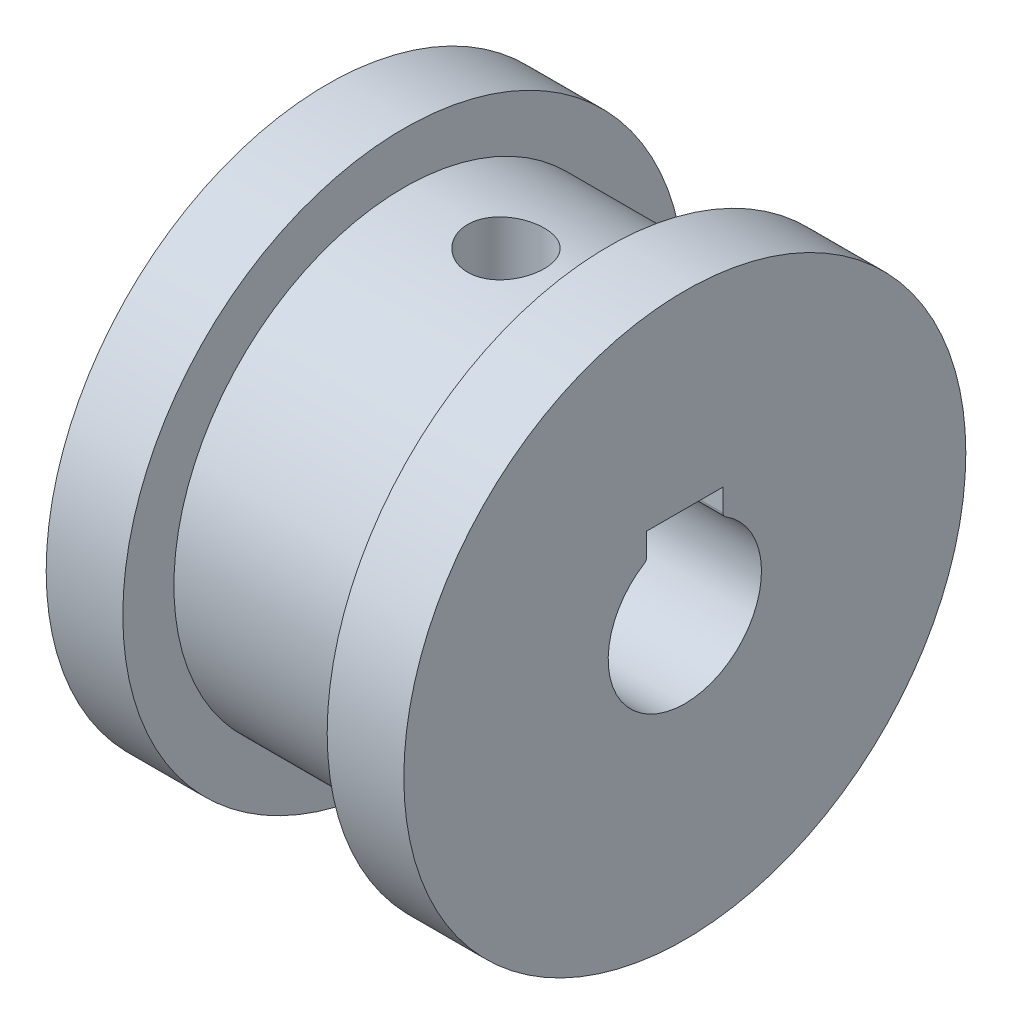
ISO-10303-21;
HEADER;
FILE_DESCRIPTION(('STEP AP214'),'2;1');
FILE_NAME('part.step','',(''),(''),'','','');
FILE_SCHEMA(('AUTOMOTIVE_DESIGN { 1 0 10303 214 1 1 1 1 }'));
ENDSEC;
DATA;
#1=APPLICATION_CONTEXT('core data for automotive mechanical design processes');
#2=APPLICATION_PROTOCOL_DEFINITION('international standard','automotive_design',2000,#1);
#3=PRODUCT_CONTEXT('',#1,'mechanical');
#4=PRODUCT('Part','Part','',(#3));
#5=PRODUCT_RELATED_PRODUCT_CATEGORY('part','',(#4));
#6=PRODUCT_DEFINITION_FORMATION('','',#4);
#7=PRODUCT_DEFINITION_CONTEXT('part definition',#1,'design');
#8=PRODUCT_DEFINITION('design','',#6,#7);
#9=PRODUCT_DEFINITION_SHAPE('','',#8);
#10=(LENGTH_UNIT() NAMED_UNIT(*) SI_UNIT(.MILLI.,.METRE.));
#11=(NAMED_UNIT(*) PLANE_ANGLE_UNIT() SI_UNIT($,.RADIAN.));
#12=(NAMED_UNIT(*) SI_UNIT($,.STERADIAN.) SOLID_ANGLE_UNIT());
#13=UNCERTAINTY_MEASURE_WITH_UNIT(LENGTH_MEASURE(1.E-05),#10,'distance_accuracy_value','');
#14=(GEOMETRIC_REPRESENTATION_CONTEXT(3) GLOBAL_UNCERTAINTY_ASSIGNED_CONTEXT((#13)) GLOBAL_UNIT_ASSIGNED_CONTEXT((#10,
#11,#12)) REPRESENTATION_CONTEXT('',''));
#15=CARTESIAN_POINT('',(0.,0.,0.));
#16=DIRECTION('',(0.,0.,1.));
#17=DIRECTION('',(1.,0.,0.));
#18=AXIS2_PLACEMENT_3D('',#15,#16,#17);
#19=CARTESIAN_POINT('',(11.,3.59807621135332,1.5));
#20=DIRECTION('',(0.,-1.,0.));
#21=DIRECTION('',(0.,0.,-1.));
#22=AXIS2_PLACEMENT_3D('',#19,#20,#21);
#23=PLANE('',#22);
#24=CARTESIAN_POINT('',(4.,3.59807621135332,0.));
#25=DIRECTION('',(0.,-1.,0.));
#26=DIRECTION('',(0.,0.,-1.));
#27=AXIS2_PLACEMENT_3D('',#24,#25,#26);
#28=CIRCLE('',#27,1.5);
#29=CARTESIAN_POINT('',(4.,3.59807621135332,-1.5));
#30=VERTEX_POINT('',#29);
#31=CARTESIAN_POINT('',(4.,3.59807621135332,1.5));
#32=VERTEX_POINT('',#31);
#33=EDGE_CURVE('E48',#30,#32,#28,.T.);
#34=ORIENTED_EDGE('',*,*,#33,.F.);
#35=DIRECTION('',(-1.,0.,0.));
#36=VECTOR('',#35,1.);
#37=CARTESIAN_POINT('',(11.,3.59807621135332,-1.5));
#38=LINE('',#37,#36);
#39=CARTESIAN_POINT('',(11.,3.59807621135332,-1.5));
#40=VERTEX_POINT('',#39);
#41=EDGE_CURVE('E100',#40,#30,#38,.T.);
#42=ORIENTED_EDGE('',*,*,#41,.F.);
#43=DIRECTION('',(0.,0.,1.));
#44=VECTOR('',#43,1.);
#45=CARTESIAN_POINT('',(11.,3.59807621135332,1.5));
#46=LINE('',#45,#44);
#47=CARTESIAN_POINT('',(11.,3.59807621135332,1.5));
#48=VERTEX_POINT('',#47);
#49=EDGE_CURVE('E217',#40,#48,#46,.T.);
#50=ORIENTED_EDGE('',*,*,#49,.T.);
#51=DIRECTION('',(-1.,0.,0.));
#52=VECTOR('',#51,1.);
#53=CARTESIAN_POINT('',(11.,3.59807621135332,1.5));
#54=LINE('',#53,#52);
#55=EDGE_CURVE('E56',#48,#32,#54,.T.);
#56=ORIENTED_EDGE('',*,*,#55,.T.);
#57=EDGE_LOOP('',(#34,#42,#50,#56));
#58=FACE_BOUND('',#57,.T.);
#59=ADVANCED_FACE('F32',(#58),#23,.T.);
#60=CARTESIAN_POINT('',(11.,0.,0.));
#61=DIRECTION('',(1.,0.,0.));
#62=DIRECTION('',(0.,0.,-1.));
#63=AXIS2_PLACEMENT_3D('',#60,#61,#62);
#64=PLANE('',#63);
#65=CARTESIAN_POINT('',(11.,0.,0.));
#66=DIRECTION('',(1.,0.,0.));
#67=DIRECTION('',(0.,0.,-1.));
#68=AXIS2_PLACEMENT_3D('',#65,#66,#67);
#69=CIRCLE('',#68,11.);
#70=CARTESIAN_POINT('',(11.,0.,-11.));
#71=VERTEX_POINT('',#70);
#72=EDGE_CURVE('E42',#71,#71,#69,.T.);
#73=ORIENTED_EDGE('',*,*,#72,.T.);
#74=EDGE_LOOP('',(#73));
#75=FACE_BOUND('',#74,.T.);
#76=CARTESIAN_POINT('',(11.,0.,0.));
#77=DIRECTION('',(1.,0.,0.));
#78=DIRECTION('',(0.,0.,-1.));
#79=AXIS2_PLACEMENT_3D('',#76,#77,#78);
#80=CIRCLE('',#79,3.);
#81=CARTESIAN_POINT('',(11.,2.54164532094862,1.59375));
#82=VERTEX_POINT('',#81);
#83=CARTESIAN_POINT('',(11.,2.54164532094862,-1.59375));
#84=VERTEX_POINT('',#83);
#85=EDGE_CURVE('E207',#82,#84,#80,.T.);
#86=ORIENTED_EDGE('',*,*,#85,.F.);
#87=CARTESIAN_POINT('',(11.,2.71108834234519,1.7));
#88=DIRECTION('',(-1.,0.,0.));
#89=DIRECTION('',(0.,0.,-1.));
#90=AXIS2_PLACEMENT_3D('',#87,#88,#89);
#91=CIRCLE('',#90,0.2);
#92=CARTESIAN_POINT('',(11.,2.71108834234519,1.5));
#93=VERTEX_POINT('',#92);
#94=EDGE_CURVE('E205',#93,#82,#91,.T.);
#95=ORIENTED_EDGE('',*,*,#94,.F.);
#96=DIRECTION('',(0.,-1.,0.));
#97=VECTOR('',#96,1.);
#98=CARTESIAN_POINT('',(11.,3.59807621135332,1.5));
#99=LINE('',#98,#97);
#100=EDGE_CURVE('E219',#48,#93,#99,.T.);
#101=ORIENTED_EDGE('',*,*,#100,.F.);
#102=ORIENTED_EDGE('',*,*,#49,.F.);
#103=DIRECTION('',(0.,1.,0.));
#104=VECTOR('',#103,1.);
#105=CARTESIAN_POINT('',(11.,3.59807621135332,-1.5));
#106=LINE('',#105,#104);
#107=CARTESIAN_POINT('',(11.,2.71108834234519,-1.5));
#108=VERTEX_POINT('',#107);
#109=EDGE_CURVE('E115',#108,#40,#106,.T.);
#110=ORIENTED_EDGE('',*,*,#109,.F.);
#111=CARTESIAN_POINT('',(11.,2.71108834234519,-1.7));
#112=DIRECTION('',(-1.,0.,0.));
#113=DIRECTION('',(0.,0.,1.));
#114=AXIS2_PLACEMENT_3D('',#111,#112,#113);
#115=CIRCLE('',#114,0.2);
#116=EDGE_CURVE('E214',#84,#108,#115,.T.);
#117=ORIENTED_EDGE('',*,*,#116,.F.);
#118=EDGE_LOOP('',(#86,#95,#101,#102,#110,#117));
#119=FACE_BOUND('',#118,.T.);
#120=ADVANCED_FACE('F162',(#75,#119),#64,.T.);
#121=CARTESIAN_POINT('',(-3.,0.,0.));
#122=DIRECTION('',(-1.,0.,0.));
#123=DIRECTION('',(0.,0.,1.));
#124=AXIS2_PLACEMENT_3D('',#121,#122,#123);
#125=PLANE('',#124);
#126=CARTESIAN_POINT('',(-3.,0.,0.));
#127=DIRECTION('',(-1.,0.,0.));
#128=DIRECTION('',(0.,0.,1.));
#129=AXIS2_PLACEMENT_3D('',#126,#127,#128);
#130=CIRCLE('',#129,11.);
#131=CARTESIAN_POINT('',(-3.,0.,11.));
#132=VERTEX_POINT('',#131);
#133=EDGE_CURVE('E126',#132,#132,#130,.T.);
#134=ORIENTED_EDGE('',*,*,#133,.T.);
#135=EDGE_LOOP('',(#134));
#136=FACE_BOUND('',#135,.T.);
#137=DIRECTION('',(0.,-1.,0.));
#138=VECTOR('',#137,1.);
#139=CARTESIAN_POINT('',(-3.,3.59807621135332,1.5));
#140=LINE('',#139,#138);
#141=CARTESIAN_POINT('',(-3.,3.59807621135332,1.5));
#142=VERTEX_POINT('',#141);
#143=CARTESIAN_POINT('',(-3.,2.71108834234519,1.5));
#144=VERTEX_POINT('',#143);
#145=EDGE_CURVE('E201',#142,#144,#140,.T.);
#146=ORIENTED_EDGE('',*,*,#145,.T.);
#147=CARTESIAN_POINT('',(-3.,2.71108834234519,1.7));
#148=DIRECTION('',(-1.,0.,0.));
#149=DIRECTION('',(0.,0.,-1.));
#150=AXIS2_PLACEMENT_3D('',#147,#148,#149);
#151=CIRCLE('',#150,0.2);
#152=CARTESIAN_POINT('',(-3.,2.54164532094862,1.59375));
#153=VERTEX_POINT('',#152);
#154=EDGE_CURVE('E203',#144,#153,#151,.T.);
#155=ORIENTED_EDGE('',*,*,#154,.T.);
#156=CARTESIAN_POINT('',(-3.,0.,0.));
#157=DIRECTION('',(1.,0.,0.));
#158=DIRECTION('',(0.,0.,-1.));
#159=AXIS2_PLACEMENT_3D('',#156,#157,#158);
#160=CIRCLE('',#159,3.);
#161=CARTESIAN_POINT('',(-3.,2.54164532094862,-1.59375));
#162=VERTEX_POINT('',#161);
#163=EDGE_CURVE('E234',#153,#162,#160,.T.);
#164=ORIENTED_EDGE('',*,*,#163,.T.);
#165=CARTESIAN_POINT('',(-3.,2.71108834234519,-1.7));
#166=DIRECTION('',(-1.,0.,0.));
#167=DIRECTION('',(0.,0.,1.));
#168=AXIS2_PLACEMENT_3D('',#165,#166,#167);
#169=CIRCLE('',#168,0.2);
#170=CARTESIAN_POINT('',(-3.,2.71108834234519,-1.5));
#171=VERTEX_POINT('',#170);
#172=EDGE_CURVE('E233',#162,#171,#169,.T.);
#173=ORIENTED_EDGE('',*,*,#172,.T.);
#174=DIRECTION('',(0.,1.,0.));
#175=VECTOR('',#174,1.);
#176=CARTESIAN_POINT('',(-3.,3.59807621135332,-1.5));
#177=LINE('',#176,#175);
#178=CARTESIAN_POINT('',(-3.,3.59807621135332,-1.5));
#179=VERTEX_POINT('',#178);
#180=EDGE_CURVE('E209',#171,#179,#177,.T.);
#181=ORIENTED_EDGE('',*,*,#180,.T.);
#182=DIRECTION('',(0.,0.,1.));
#183=VECTOR('',#182,1.);
#184=CARTESIAN_POINT('',(-3.,3.59807621135332,1.5));
#185=LINE('',#184,#183);
#186=EDGE_CURVE('E107',#179,#142,#185,.T.);
#187=ORIENTED_EDGE('',*,*,#186,.T.);
#188=EDGE_LOOP('',(#146,#155,#164,#173,#181,#187));
#189=FACE_BOUND('',#188,.T.);
#190=ADVANCED_FACE('F167',(#136,#189),#125,.T.);
#191=CARTESIAN_POINT('',(8.,0.,0.));
#192=DIRECTION('',(-1.,0.,0.));
#193=DIRECTION('',(0.,0.,1.));
#194=AXIS2_PLACEMENT_3D('',#191,#192,#193);
#195=CYLINDRICAL_SURFACE('',#194,9.);
#196=CARTESIAN_POINT('',(4.,8.87411967464942,-1.5));
#197=CARTESIAN_POINT('',(4.08362544888762,8.87412118440766,-1.4999966390526));
#198=CARTESIAN_POINT('',(4.16729656361492,8.8753145552884,-1.49298310142239));
#199=CARTESIAN_POINT('',(4.3322911259321,8.87995474420907,-1.46512645684523));
#200=CARTESIAN_POINT('',(4.41361233624971,8.88340364034856,-1.44427059618579));
#201=CARTESIAN_POINT('',(4.57149537001406,8.89215365593394,-1.38937772620028));
#202=CARTESIAN_POINT('',(4.64806110919979,8.8974532270317,-1.35535173295865));
#203=CARTESIAN_POINT('',(4.79438857282822,8.90930563268603,-1.27511189813422));
#204=CARTESIAN_POINT('',(4.86415106174574,8.91585832618484,-1.22889942810094));
#205=CARTESIAN_POINT('',(4.9955877098474,8.92955082691565,-1.12511251617978));
#206=CARTESIAN_POINT('',(5.05718507883191,8.93669530396241,-1.06744142935936));
#207=CARTESIAN_POINT('',(5.16987598411691,8.95072488401674,-0.942583202817202));
#208=CARTESIAN_POINT('',(5.2209688978692,8.95760997163182,-0.875395499489992));
#209=CARTESIAN_POINT('',(5.31148874033161,8.97039442189482,-0.732913721969002));
#210=CARTESIAN_POINT('',(5.35084420463909,8.97628765459366,-0.657573648874021));
#211=CARTESIAN_POINT('',(5.41631264231832,8.98637242174293,-0.501237373034323));
#212=CARTESIAN_POINT('',(5.44242647673092,8.99056406683605,-0.420241538446913));
#213=CARTESIAN_POINT('',(5.48043552099034,8.99674040834628,-0.255686235806544));
#214=CARTESIAN_POINT('',(5.49245974960281,8.99874511866543,-0.172157332007562));
#215=CARTESIAN_POINT('',(5.50234945249156,9.00039047605668,-0.0042451713154779));
#216=CARTESIAN_POINT('',(5.50021588914834,9.00003128381585,0.0801380271173395));
#217=CARTESIAN_POINT('',(5.48195118908307,8.99700515058833,0.246481311047326));
#218=CARTESIAN_POINT('',(5.46595890195451,8.99436110215438,0.328457118420085));
#219=CARTESIAN_POINT('',(5.4206493554521,8.98708787262982,0.488545187767075));
#220=CARTESIAN_POINT('',(5.3913316902463,8.98245863107927,0.566657331990903));
#221=CARTESIAN_POINT('',(5.32006561581081,8.97169619107174,0.717213688669589));
#222=CARTESIAN_POINT('',(5.27805999275053,8.96555620396128,0.789630313811427));
#223=CARTESIAN_POINT('',(5.18265230641897,8.95245442842898,0.926439317907985));
#224=CARTESIAN_POINT('',(5.12924932077351,8.94549257351481,0.990831046749526));
#225=CARTESIAN_POINT('',(5.01179271602842,8.93142160939558,1.110582764068));
#226=CARTESIAN_POINT('',(4.94761774305941,8.92431173838625,1.16582370135192));
#227=CARTESIAN_POINT('',(4.81084774587051,8.91082775870883,1.26477275306884));
#228=CARTESIAN_POINT('',(4.73825264399031,8.90445365682795,1.30848076111945));
#229=CARTESIAN_POINT('',(4.58656501487351,8.8931625273709,1.38314666069297));
#230=CARTESIAN_POINT('',(4.50746530114474,8.88824713981561,1.41409021636755));
#231=CARTESIAN_POINT('',(4.34509055661547,8.88045713213928,1.46221792248937));
#232=CARTESIAN_POINT('',(4.26181589414054,8.87758233232993,1.47940328446077));
#233=CARTESIAN_POINT('',(4.09452030630272,8.8742337565327,1.49935913092756));
#234=CARTESIAN_POINT('',(4.01052017217874,8.87373171455201,1.50229932474746));
#235=CARTESIAN_POINT('',(3.84322799698551,8.87511020869417,1.49413362160947));
#236=CARTESIAN_POINT('',(3.75993592869161,8.87699065279112,1.4830282671748));
#237=CARTESIAN_POINT('',(3.59696334448548,8.88289612473011,1.44723140095686));
#238=CARTESIAN_POINT('',(3.51726331607319,8.88690751151009,1.42262627438783));
#239=CARTESIAN_POINT('',(3.36311790023231,8.89661143803301,1.36061891411537));
#240=CARTESIAN_POINT('',(3.28867282746946,8.90230407834347,1.32321591486056));
#241=CARTESIAN_POINT('',(3.14639524335633,8.91479477038436,1.23627400393754));
#242=CARTESIAN_POINT('',(3.07863005634636,8.92160253360208,1.18662633849562));
#243=CARTESIAN_POINT('',(2.952331880383,8.9355280000792,1.07675367942479));
#244=CARTESIAN_POINT('',(2.89379954133415,8.94264572511199,1.01652794183043));
#245=CARTESIAN_POINT('',(2.78700886436278,8.95647853270958,0.886456842197286));
#246=CARTESIAN_POINT('',(2.73886370422927,8.96318865806803,0.816517952031718));
#247=CARTESIAN_POINT('',(2.65500680379707,8.97537067459765,0.669446068769596));
#248=CARTESIAN_POINT('',(2.61929466131569,8.98084260581985,0.592313308482376));
#249=CARTESIAN_POINT('',(2.56149364962708,8.9899101490175,0.433379430900796));
#250=CARTESIAN_POINT('',(2.53934555455905,8.99351390740573,0.351600337561566));
#251=CARTESIAN_POINT('',(2.5091106406217,8.99847349901569,0.185418440924527));
#252=CARTESIAN_POINT('',(2.50102266476058,8.99982951720106,0.101015854092974));
#253=CARTESIAN_POINT('',(2.49917087061268,9.00013822732695,-0.0669247654642084));
#254=CARTESIAN_POINT('',(2.50523484763537,8.99911981214543,-0.150460896361608));
#255=CARTESIAN_POINT('',(2.53114235336164,8.99485307032369,-0.315307184588814));
#256=CARTESIAN_POINT('',(2.55098580490574,8.99160475617001,-0.396617354380455));
#257=CARTESIAN_POINT('',(2.60382289932625,8.98324193296551,-0.554637867551155));
#258=CARTESIAN_POINT('',(2.63680190092627,8.97812950224933,-0.631353223292413));
#259=CARTESIAN_POINT('',(2.71495476173811,8.96659654126411,-0.778188271789179));
#260=CARTESIAN_POINT('',(2.76012919903658,8.96017594898929,-0.848307651670478));
#261=CARTESIAN_POINT('',(2.8620010554772,8.94664577771383,-0.980827767316295));
#262=CARTESIAN_POINT('',(2.91882457285412,8.9395291473044,-1.04313085836337));
#263=CARTESIAN_POINT('',(3.04211698473891,8.92545781982852,-1.15737832556883));
#264=CARTESIAN_POINT('',(3.10858813533493,8.91850316108162,-1.20932027202071));
#265=CARTESIAN_POINT('',(3.24984719350458,8.90549006142059,-1.30170856255177));
#266=CARTESIAN_POINT('',(3.32469060390283,8.89943830788741,-1.34207099345672));
#267=CARTESIAN_POINT('',(3.48016554154686,8.88899526133062,-1.40958872186455));
#268=CARTESIAN_POINT('',(3.56079119361813,8.88460231050764,-1.43675721313896));
#269=CARTESIAN_POINT('',(3.701442261686,8.87894846902668,-1.47121563187328));
#270=CARTESIAN_POINT('',(3.76061608477506,8.8771477405261,-1.48199245060217));
#271=CARTESIAN_POINT('',(3.87985209090466,8.87473281171912,-1.49638577710945));
#272=CARTESIAN_POINT('',(3.9399142577981,8.87411858987266,-1.50000241487515));
#273=CARTESIAN_POINT('',(4.,8.87411967464942,-1.5));
#274=B_SPLINE_CURVE_WITH_KNOTS('',3,(#196,#197,#198,#199,#200,#201,#202,#203,#204,#205,#206,
#207,#208,#209,#210,#211,#212,#213,#214,#215,#216,#217,#218,#219,#220,#221,#222,#223,#224,#225,
#226,#227,#228,#229,#230,#231,#232,#233,#234,#235,#236,#237,#238,#239,#240,#241,#242,#243,#244,
#245,#246,#247,#248,#249,#250,#251,#252,#253,#254,#255,#256,#257,#258,#259,#260,#261,#262,#263,
#264,#265,#266,#267,#268,#269,#270,#271,#272,#273),.UNSPECIFIED.,.T.,.F.,(4,2,2,2,2,2,2,2,2,2,2,
2,2,2,2,2,2,2,2,2,2,2,2,2,2,2,2,2,2,2,2,2,2,2,2,2,2,2,4),(0.,0.250656623343191,
0.501544511951669,0.752222998698999,1.00287328440553,1.25573495490818,1.50861160698057,
1.7629978806425,2.01736761064056,2.26938940480928,2.52139406789004,2.7709027269619,
3.02041898547108,3.27107762481044,3.52175655733447,3.77547674074663,4.02919926445,
4.28320597496551,4.53719031560235,4.78814125449635,5.03908250045774,5.28843638778684,
5.53780519373533,5.7894740565501,6.04116062655802,6.29546467818618,6.54976050283408,
6.80293790647977,7.05609447544799,7.30618665756939,7.55627743928683,7.80609023896863,
8.0559148823279,8.3086019847534,8.56134827326476,8.8158823656771,9.07016140042576,
9.25026402322163,9.43036337636995),.UNSPECIFIED.);
#275=CARTESIAN_POINT('',(4.,8.87411967464942,-1.5));
#276=VERTEX_POINT('',#275);
#277=EDGE_CURVE('E102',#276,#276,#274,.T.);
#278=ORIENTED_EDGE('',*,*,#277,.T.);
#279=EDGE_LOOP('',(#278));
#280=FACE_BOUND('',#279,.T.);
#281=CARTESIAN_POINT('',(8.,0.,0.));
#282=DIRECTION('',(1.,0.,0.));
#283=DIRECTION('',(0.,0.,-1.));
#284=AXIS2_PLACEMENT_3D('',#281,#282,#283);
#285=CIRCLE('',#284,9.);
#286=CARTESIAN_POINT('',(8.,0.,-9.));
#287=VERTEX_POINT('',#286);
#288=EDGE_CURVE('E11',#287,#287,#285,.T.);
#289=ORIENTED_EDGE('',*,*,#288,.F.);
#290=EDGE_LOOP('',(#289));
#291=FACE_BOUND('',#290,.T.);
#292=CARTESIAN_POINT('',(0.,0.,0.));
#293=DIRECTION('',(1.,0.,0.));
#294=DIRECTION('',(0.,0.,-1.));
#295=AXIS2_PLACEMENT_3D('',#292,#293,#294);
#296=CIRCLE('',#295,9.);
#297=CARTESIAN_POINT('',(0.,0.,-9.));
#298=VERTEX_POINT('',#297);
#299=EDGE_CURVE('E37',#298,#298,#296,.T.);
#300=ORIENTED_EDGE('',*,*,#299,.T.);
#301=EDGE_LOOP('',(#300));
#302=FACE_BOUND('',#301,.T.);
#303=ADVANCED_FACE('F34',(#280,#291,#302),#195,.T.);
#304=CARTESIAN_POINT('',(11.,0.,0.));
#305=DIRECTION('',(-1.,0.,0.));
#306=DIRECTION('',(0.,0.,1.));
#307=AXIS2_PLACEMENT_3D('',#304,#305,#306);
#308=CYLINDRICAL_SURFACE('',#307,11.);
#309=ORIENTED_EDGE('',*,*,#72,.F.);
#310=EDGE_LOOP('',(#309));
#311=FACE_BOUND('',#310,.T.);
#312=CARTESIAN_POINT('',(8.,0.,0.));
#313=DIRECTION('',(1.,0.,0.));
#314=DIRECTION('',(0.,0.,-1.));
#315=AXIS2_PLACEMENT_3D('',#312,#313,#314);
#316=CIRCLE('',#315,11.);
#317=CARTESIAN_POINT('',(8.,0.,-11.));
#318=VERTEX_POINT('',#317);
#319=EDGE_CURVE('E133',#318,#318,#316,.T.);
#320=ORIENTED_EDGE('',*,*,#319,.T.);
#321=EDGE_LOOP('',(#320));
#322=FACE_BOUND('',#321,.T.);
#323=ADVANCED_FACE('F156',(#311,#322),#308,.T.);
#324=CARTESIAN_POINT('',(8.,0.,0.));
#325=DIRECTION('',(1.,0.,0.));
#326=DIRECTION('',(0.,0.,-1.));
#327=AXIS2_PLACEMENT_3D('',#324,#325,#326);
#328=PLANE('',#327);
#329=ORIENTED_EDGE('',*,*,#288,.T.);
#330=EDGE_LOOP('',(#329));
#331=FACE_BOUND('',#330,.T.);
#332=ORIENTED_EDGE('',*,*,#319,.F.);
#333=EDGE_LOOP('',(#332));
#334=FACE_BOUND('',#333,.T.);
#335=ADVANCED_FACE('F150',(#331,#334),#328,.F.);
#336=CARTESIAN_POINT('',(-3.,0.,0.));
#337=DIRECTION('',(1.,0.,0.));
#338=DIRECTION('',(0.,0.,-1.));
#339=AXIS2_PLACEMENT_3D('',#336,#337,#338);
#340=CYLINDRICAL_SURFACE('',#339,11.);
#341=ORIENTED_EDGE('',*,*,#133,.F.);
#342=EDGE_LOOP('',(#341));
#343=FACE_BOUND('',#342,.T.);
#344=CARTESIAN_POINT('',(0.,0.,0.));
#345=DIRECTION('',(-1.,0.,0.));
#346=DIRECTION('',(0.,0.,1.));
#347=AXIS2_PLACEMENT_3D('',#344,#345,#346);
#348=CIRCLE('',#347,11.);
#349=CARTESIAN_POINT('',(0.,0.,11.));
#350=VERTEX_POINT('',#349);
#351=EDGE_CURVE('E125',#350,#350,#348,.T.);
#352=ORIENTED_EDGE('',*,*,#351,.T.);
#353=EDGE_LOOP('',(#352));
#354=FACE_BOUND('',#353,.T.);
#355=ADVANCED_FACE('F145',(#343,#354),#340,.T.);
#356=CARTESIAN_POINT('',(0.,0.,0.));
#357=DIRECTION('',(-1.,0.,0.));
#358=DIRECTION('',(0.,0.,1.));
#359=AXIS2_PLACEMENT_3D('',#356,#357,#358);
#360=PLANE('',#359);
#361=ORIENTED_EDGE('',*,*,#299,.F.);
#362=EDGE_LOOP('',(#361));
#363=FACE_BOUND('',#362,.T.);
#364=ORIENTED_EDGE('',*,*,#351,.F.);
#365=EDGE_LOOP('',(#364));
#366=FACE_BOUND('',#365,.T.);
#367=ADVANCED_FACE('F141',(#363,#366),#360,.F.);
#368=CARTESIAN_POINT('',(11.,2.71108834234519,1.7));
#369=DIRECTION('',(-1.,0.,0.));
#370=DIRECTION('',(0.,0.,1.));
#371=AXIS2_PLACEMENT_3D('',#368,#369,#370);
#372=CYLINDRICAL_SURFACE('',#371,0.2);
#373=DIRECTION('',(-1.,0.,0.));
#374=VECTOR('',#373,1.);
#375=CARTESIAN_POINT('',(11.,2.71108834234519,1.5));
#376=LINE('',#375,#374);
#377=EDGE_CURVE('E220',#93,#144,#376,.T.);
#378=ORIENTED_EDGE('',*,*,#377,.F.);
#379=ORIENTED_EDGE('',*,*,#94,.T.);
#380=DIRECTION('',(-1.,0.,0.));
#381=VECTOR('',#380,1.);
#382=CARTESIAN_POINT('',(11.,2.54164532094862,1.59375));
#383=LINE('',#382,#381);
#384=EDGE_CURVE('E123',#82,#153,#383,.T.);
#385=ORIENTED_EDGE('',*,*,#384,.T.);
#386=ORIENTED_EDGE('',*,*,#154,.F.);
#387=EDGE_LOOP('',(#378,#379,#385,#386));
#388=FACE_BOUND('',#387,.T.);
#389=ADVANCED_FACE('F144',(#388),#372,.T.);
#390=CARTESIAN_POINT('',(11.,0.,0.));
#391=DIRECTION('',(-1.,0.,0.));
#392=DIRECTION('',(0.,0.,1.));
#393=AXIS2_PLACEMENT_3D('',#390,#391,#392);
#394=CYLINDRICAL_SURFACE('',#393,3.);
#395=ORIENTED_EDGE('',*,*,#384,.F.);
#396=ORIENTED_EDGE('',*,*,#85,.T.);
#397=DIRECTION('',(-1.,0.,0.));
#398=VECTOR('',#397,1.);
#399=CARTESIAN_POINT('',(11.,2.54164532094862,-1.59375));
#400=LINE('',#399,#398);
#401=EDGE_CURVE('E117',#84,#162,#400,.T.);
#402=ORIENTED_EDGE('',*,*,#401,.T.);
#403=ORIENTED_EDGE('',*,*,#163,.F.);
#404=EDGE_LOOP('',(#395,#396,#402,#403));
#405=FACE_BOUND('',#404,.T.);
#406=ADVANCED_FACE('F181',(#405),#394,.F.);
#407=CARTESIAN_POINT('',(11.,2.71108834234519,-1.7));
#408=DIRECTION('',(-1.,0.,0.));
#409=DIRECTION('',(0.,0.,1.));
#410=AXIS2_PLACEMENT_3D('',#407,#408,#409);
#411=CYLINDRICAL_SURFACE('',#410,0.2);
#412=ORIENTED_EDGE('',*,*,#401,.F.);
#413=ORIENTED_EDGE('',*,*,#116,.T.);
#414=DIRECTION('',(-1.,0.,0.));
#415=VECTOR('',#414,1.);
#416=CARTESIAN_POINT('',(11.,2.71108834234519,-1.5));
#417=LINE('',#416,#415);
#418=EDGE_CURVE('E116',#108,#171,#417,.T.);
#419=ORIENTED_EDGE('',*,*,#418,.T.);
#420=ORIENTED_EDGE('',*,*,#172,.F.);
#421=EDGE_LOOP('',(#412,#413,#419,#420));
#422=FACE_BOUND('',#421,.T.);
#423=ADVANCED_FACE('F177',(#422),#411,.T.);
#424=CARTESIAN_POINT('',(11.,3.59807621135332,-1.5));
#425=DIRECTION('',(0.,0.,1.));
#426=DIRECTION('',(0.,-1.,0.));
#427=AXIS2_PLACEMENT_3D('',#424,#425,#426);
#428=PLANE('',#427);
#429=ORIENTED_EDGE('',*,*,#418,.F.);
#430=ORIENTED_EDGE('',*,*,#109,.T.);
#431=ORIENTED_EDGE('',*,*,#41,.T.);
#432=EDGE_CURVE('E104',#30,#179,#38,.T.);
#433=ORIENTED_EDGE('',*,*,#432,.T.);
#434=ORIENTED_EDGE('',*,*,#180,.F.);
#435=EDGE_LOOP('',(#429,#430,#431,#433,#434));
#436=FACE_BOUND('',#435,.T.);
#437=ADVANCED_FACE('F113',(#436),#428,.T.);
#438=EDGE_CURVE('E91',#32,#30,#28,.T.);
#439=ORIENTED_EDGE('',*,*,#438,.F.);
#440=EDGE_CURVE('E221',#32,#142,#54,.T.);
#441=ORIENTED_EDGE('',*,*,#440,.T.);
#442=ORIENTED_EDGE('',*,*,#186,.F.);
#443=ORIENTED_EDGE('',*,*,#432,.F.);
#444=EDGE_LOOP('',(#439,#441,#442,#443));
#445=FACE_BOUND('',#444,.T.);
#446=ADVANCED_FACE('F105',(#445),#23,.T.);
#447=CARTESIAN_POINT('',(11.,3.59807621135332,1.5));
#448=DIRECTION('',(0.,0.,-1.));
#449=DIRECTION('',(0.,1.,0.));
#450=AXIS2_PLACEMENT_3D('',#447,#448,#449);
#451=PLANE('',#450);
#452=ORIENTED_EDGE('',*,*,#55,.F.);
#453=ORIENTED_EDGE('',*,*,#100,.T.);
#454=ORIENTED_EDGE('',*,*,#377,.T.);
#455=ORIENTED_EDGE('',*,*,#145,.F.);
#456=ORIENTED_EDGE('',*,*,#440,.F.);
#457=EDGE_LOOP('',(#452,#453,#454,#455,#456));
#458=FACE_BOUND('',#457,.T.);
#459=ADVANCED_FACE('F172',(#458),#451,.T.);
#460=CARTESIAN_POINT('',(4.,9.59807621135332,0.));
#461=DIRECTION('',(0.,-1.,0.));
#462=DIRECTION('',(0.,0.,-1.));
#463=AXIS2_PLACEMENT_3D('',#460,#461,#462);
#464=CYLINDRICAL_SURFACE('',#463,1.5);
#465=ORIENTED_EDGE('',*,*,#33,.T.);
#466=ORIENTED_EDGE('',*,*,#438,.T.);
#467=EDGE_LOOP('',(#465,#466));
#468=FACE_BOUND('',#467,.T.);
#469=ORIENTED_EDGE('',*,*,#277,.F.);
#470=EDGE_LOOP('',(#469));
#471=FACE_BOUND('',#470,.T.);
#472=ADVANCED_FACE('F92',(#468,#471),#464,.F.);
#473=CLOSED_SHELL('',(#59,#120,#190,#303,#323,#335,#355,#367,#389,#406,#423,#437,#446,#459,#472));
#474=MANIFOLD_SOLID_BREP('B2',#473);
#475=ADVANCED_BREP_SHAPE_REPRESENTATION('',(#18,#474),#14);
#476=SHAPE_DEFINITION_REPRESENTATION(#9,#475);
ENDSEC;
END-ISO-10303-21;
